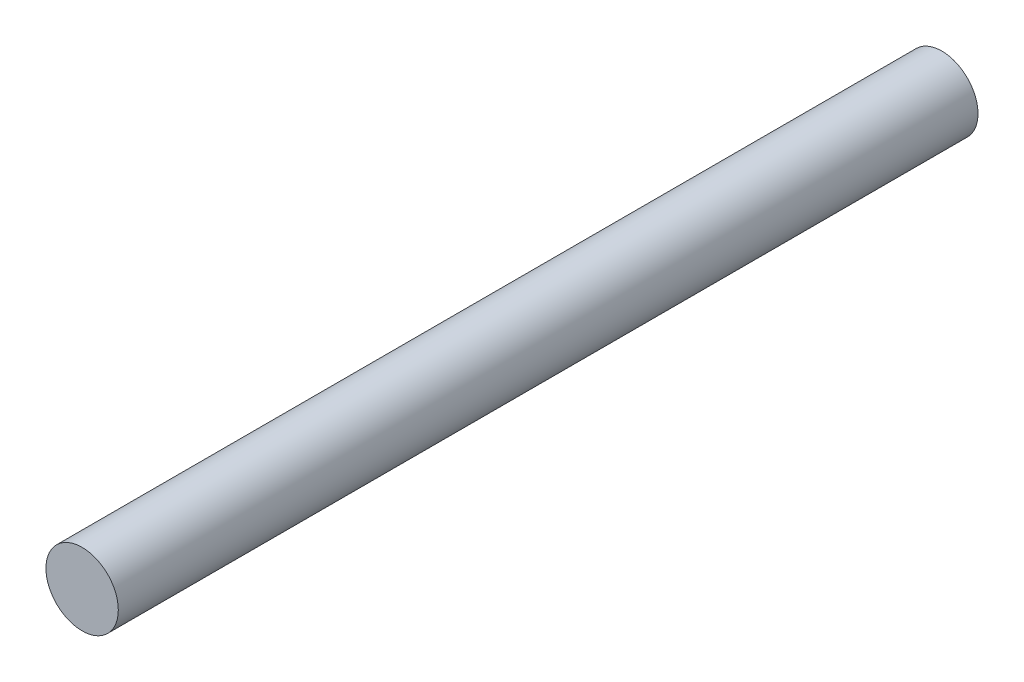
ISO-10303-21;
HEADER;
FILE_DESCRIPTION(('STEP AP214'),'2;1');
FILE_NAME('part.step','',(''),(''),'','','');
FILE_SCHEMA(('AUTOMOTIVE_DESIGN { 1 0 10303 214 1 1 1 1 }'));
ENDSEC;
DATA;
#1=APPLICATION_CONTEXT('core data for automotive mechanical design processes');
#2=APPLICATION_PROTOCOL_DEFINITION('international standard','automotive_design',2000,#1);
#3=PRODUCT_CONTEXT('',#1,'mechanical');
#4=PRODUCT('Part','Part','',(#3));
#5=PRODUCT_RELATED_PRODUCT_CATEGORY('part','',(#4));
#6=PRODUCT_DEFINITION_FORMATION('','',#4);
#7=PRODUCT_DEFINITION_CONTEXT('part definition',#1,'design');
#8=PRODUCT_DEFINITION('design','',#6,#7);
#9=PRODUCT_DEFINITION_SHAPE('','',#8);
#10=(LENGTH_UNIT() NAMED_UNIT(*) SI_UNIT(.MILLI.,.METRE.));
#11=(NAMED_UNIT(*) PLANE_ANGLE_UNIT() SI_UNIT($,.RADIAN.));
#12=(NAMED_UNIT(*) SI_UNIT($,.STERADIAN.) SOLID_ANGLE_UNIT());
#13=UNCERTAINTY_MEASURE_WITH_UNIT(LENGTH_MEASURE(1.E-05),#10,'distance_accuracy_value','');
#14=(GEOMETRIC_REPRESENTATION_CONTEXT(3) GLOBAL_UNCERTAINTY_ASSIGNED_CONTEXT((#13)) GLOBAL_UNIT_ASSIGNED_CONTEXT((#10,
#11,#12)) REPRESENTATION_CONTEXT('',''));
#15=CARTESIAN_POINT('',(0.,0.,0.));
#16=DIRECTION('',(0.,0.,1.));
#17=DIRECTION('',(1.,0.,0.));
#18=AXIS2_PLACEMENT_3D('',#15,#16,#17);
#19=CARTESIAN_POINT('',(0.,0.,-1861.1));
#20=DIRECTION('',(0.,0.,1.));
#21=DIRECTION('',(1.,0.,0.));
#22=AXIS2_PLACEMENT_3D('',#19,#20,#21);
#23=CYLINDRICAL_SURFACE('',#22,78.35);
#24=CARTESIAN_POINT('',(0.,0.,-1861.1));
#25=DIRECTION('',(0.,0.,1.));
#26=DIRECTION('',(1.,0.,0.));
#27=AXIS2_PLACEMENT_3D('',#24,#25,#26);
#28=CIRCLE('',#27,78.35);
#29=CARTESIAN_POINT('',(78.35,0.,-1861.1));
#30=VERTEX_POINT('',#29);
#31=EDGE_CURVE('E10',#30,#30,#28,.T.);
#32=ORIENTED_EDGE('',*,*,#31,.T.);
#33=EDGE_LOOP('',(#32));
#34=FACE_BOUND('',#33,.T.);
#35=CARTESIAN_POINT('',(0.,0.,0.));
#36=DIRECTION('',(0.,0.,1.));
#37=DIRECTION('',(1.,0.,0.));
#38=AXIS2_PLACEMENT_3D('',#35,#36,#37);
#39=CIRCLE('',#38,78.35);
#40=CARTESIAN_POINT('',(78.35,0.,0.));
#41=VERTEX_POINT('',#40);
#42=EDGE_CURVE('E40',#41,#41,#39,.T.);
#43=ORIENTED_EDGE('',*,*,#42,.F.);
#44=EDGE_LOOP('',(#43));
#45=FACE_BOUND('',#44,.T.);
#46=ADVANCED_FACE('F37',(#34,#45),#23,.T.);
#47=CARTESIAN_POINT('',(0.,0.,-1861.1));
#48=DIRECTION('',(0.,0.,1.));
#49=DIRECTION('',(1.,0.,0.));
#50=AXIS2_PLACEMENT_3D('',#47,#48,#49);
#51=PLANE('',#50);
#52=ORIENTED_EDGE('',*,*,#31,.F.);
#53=EDGE_LOOP('',(#52));
#54=FACE_BOUND('',#53,.T.);
#55=ADVANCED_FACE('F54',(#54),#51,.F.);
#56=CARTESIAN_POINT('',(0.,0.,0.));
#57=DIRECTION('',(0.,0.,1.));
#58=DIRECTION('',(1.,0.,0.));
#59=AXIS2_PLACEMENT_3D('',#56,#57,#58);
#60=PLANE('',#59);
#61=ORIENTED_EDGE('',*,*,#42,.T.);
#62=EDGE_LOOP('',(#61));
#63=FACE_BOUND('',#62,.T.);
#64=ADVANCED_FACE('F51',(#63),#60,.T.);
#65=CLOSED_SHELL('',(#46,#55,#64));
#66=MANIFOLD_SOLID_BREP('B2',#65);
#67=ADVANCED_BREP_SHAPE_REPRESENTATION('',(#18,#66),#14);
#68=SHAPE_DEFINITION_REPRESENTATION(#9,#67);
ENDSEC;
END-ISO-10303-21;
